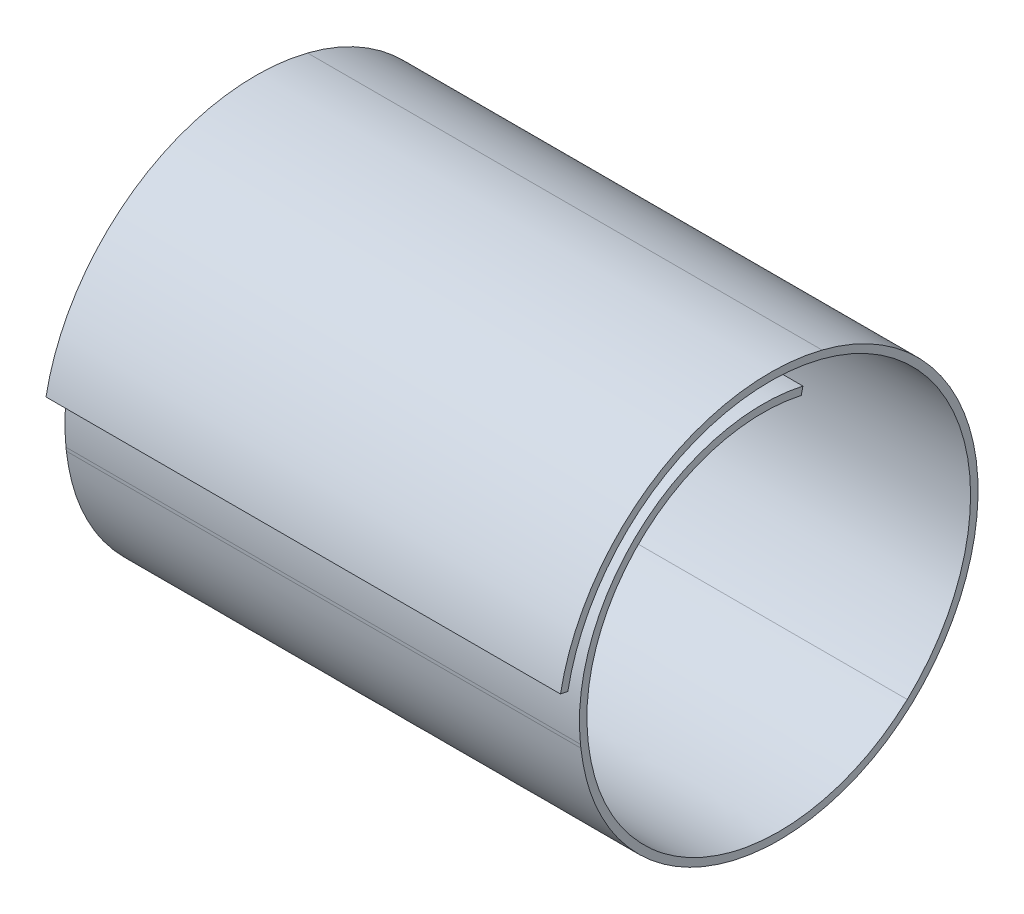
ISO-10303-21;
HEADER;
FILE_DESCRIPTION(('STEP AP214'),'2;1');
FILE_NAME('part.step','',(''),(''),'','','');
FILE_SCHEMA(('AUTOMOTIVE_DESIGN { 1 0 10303 214 1 1 1 1 }'));
ENDSEC;
DATA;
#1=APPLICATION_CONTEXT('core data for automotive mechanical design processes');
#2=APPLICATION_PROTOCOL_DEFINITION('international standard','automotive_design',2000,#1);
#3=PRODUCT_CONTEXT('',#1,'mechanical');
#4=PRODUCT('Part','Part','',(#3));
#5=PRODUCT_RELATED_PRODUCT_CATEGORY('part','',(#4));
#6=PRODUCT_DEFINITION_FORMATION('','',#4);
#7=PRODUCT_DEFINITION_CONTEXT('part definition',#1,'design');
#8=PRODUCT_DEFINITION('design','',#6,#7);
#9=PRODUCT_DEFINITION_SHAPE('','',#8);
#10=(LENGTH_UNIT() NAMED_UNIT(*) SI_UNIT(.MILLI.,.METRE.));
#11=(NAMED_UNIT(*) PLANE_ANGLE_UNIT() SI_UNIT($,.RADIAN.));
#12=(NAMED_UNIT(*) SI_UNIT($,.STERADIAN.) SOLID_ANGLE_UNIT());
#13=UNCERTAINTY_MEASURE_WITH_UNIT(LENGTH_MEASURE(1.E-05),#10,'distance_accuracy_value','');
#14=(GEOMETRIC_REPRESENTATION_CONTEXT(3) GLOBAL_UNCERTAINTY_ASSIGNED_CONTEXT((#13)) GLOBAL_UNIT_ASSIGNED_CONTEXT((#10,
#11,#12)) REPRESENTATION_CONTEXT('',''));
#15=CARTESIAN_POINT('',(0.,0.,0.));
#16=DIRECTION('',(0.,0.,1.));
#17=DIRECTION('',(1.,0.,0.));
#18=AXIS2_PLACEMENT_3D('',#15,#16,#17);
#19=CARTESIAN_POINT('',(17.4034945594457,31.576333585848,2.50708184929004));
#20=DIRECTION('',(1.,0.,0.));
#21=DIRECTION('',(0.,0.249377833365716,-0.968406266102105));
#22=AXIS2_PLACEMENT_3D('',#19,#20,#21);
#23=PLANE('',#22);
#24=CARTESIAN_POINT('',(17.4034945594457,32.0777337419169,0.56));
#25=DIRECTION('',(1.,0.,0.));
#26=DIRECTION('',(0.,0.249377833365716,-0.968406266102105));
#27=AXIS2_PLACEMENT_3D('',#24,#25,#26);
#28=CIRCLE('',#27,0.55);
#29=CARTESIAN_POINT('',(17.4034945594457,32.6112860792963,0.426501298594451));
#30=VERTEX_POINT('',#29);
#31=CARTESIAN_POINT('',(17.4034945594457,31.674989805489,0.185370131700006));
#32=VERTEX_POINT('',#31);
#33=EDGE_CURVE('E11',#30,#32,#28,.F.);
#34=ORIENTED_EDGE('',*,*,#33,.T.);
#35=CARTESIAN_POINT('',(17.4034945594457,31.6749555165695,0.185339993429392));
#36=CARTESIAN_POINT('',(17.4034945594457,31.6698808588592,0.191012359379874));
#37=CARTESIAN_POINT('',(17.4034945594457,31.6648791710446,0.196751028117828));
#38=CARTESIAN_POINT('',(17.4034945594457,31.6550659611719,0.208393311641737));
#39=CARTESIAN_POINT('',(17.4034945594457,31.6502545368846,0.214297008637968));
#40=CARTESIAN_POINT('',(17.4034945594457,31.6361815994223,0.232293079241067));
#41=CARTESIAN_POINT('',(17.4034945594457,31.6272793480714,0.244672684697817));
#42=CARTESIAN_POINT('',(17.4034945594457,31.6106773154205,0.270201991462283));
#43=CARTESIAN_POINT('',(17.4034945594457,31.6029766889723,0.283351142487258));
#44=CARTESIAN_POINT('',(17.4034945594457,31.5887690073118,0.310270250833171));
#45=CARTESIAN_POINT('',(17.4034945594457,31.5822617936804,0.324040125453596));
#46=CARTESIAN_POINT('',(17.4034945594457,31.564550945932,0.366217421023955));
#47=CARTESIAN_POINT('',(17.4034945594457,31.5551995962273,0.395428065101052));
#48=CARTESIAN_POINT('',(17.4034945594457,31.5416568436294,0.454995895010855));
#49=CARTESIAN_POINT('',(17.4034945594457,31.5374638955009,0.485352734682748));
#50=CARTESIAN_POINT('',(17.4034945594457,31.5344775086695,0.545439341617306));
#51=CARTESIAN_POINT('',(17.4034945594457,31.5355289375999,0.575161303097548));
#52=CARTESIAN_POINT('',(17.4034945594457,31.5426069674231,0.634007865221844));
#53=CARTESIAN_POINT('',(17.4034945594457,31.5486342280122,0.663132386132389));
#54=CARTESIAN_POINT('',(17.4034945594457,31.5654504846796,0.719893217469623));
#55=CARTESIAN_POINT('',(17.4034945594457,31.5762278735743,0.747532972432323));
#56=CARTESIAN_POINT('',(17.4034945594457,31.6022035468292,0.800650691027332));
#57=CARTESIAN_POINT('',(17.4034945594457,31.6174018838507,0.82612862890389));
#58=CARTESIAN_POINT('',(17.4034945594457,31.6520475540403,0.874485354845227));
#59=CARTESIAN_POINT('',(17.4034945594457,31.6715441063701,0.897328936873576));
#60=CARTESIAN_POINT('',(17.4034945594457,31.7141097694541,0.939408238404519));
#61=CARTESIAN_POINT('',(17.4034945594457,31.7371799169677,0.958642907309058));
#62=CARTESIAN_POINT('',(17.4034945594457,31.7862010867105,0.993091465363867));
#63=CARTESIAN_POINT('',(17.4034945594457,31.8121573705444,1.00829783422051));
#64=CARTESIAN_POINT('',(17.4034945594457,31.8662539162648,1.03416566326548));
#65=CARTESIAN_POINT('',(17.4034945594457,31.8943921702665,1.04483124464365));
#66=CARTESIAN_POINT('',(17.4034945594457,31.9379021368768,1.05701358362335));
#67=CARTESIAN_POINT('',(17.4034945594457,31.9527621106053,1.0604514550474));
#68=CARTESIAN_POINT('',(17.4034945594457,31.9826703312113,1.06622344220654));
#69=CARTESIAN_POINT('',(17.4034945594457,31.9977181890172,1.06855954273816));
#70=CARTESIAN_POINT('',(17.4034945594457,32.0128022203994,1.07047103077812));
#71=B_SPLINE_CURVE_WITH_KNOTS('',3,(#35,#36,#37,#38,#39,#40,#41,#42,#43,#44,#45,#46,#47,#48,#49,
#50,#51,#52,#53,#54,#55,#56,#57,#58,#59,#60,#61,#62,#63,#64,#65,#66,#67,#68,#69,#70),
.UNSPECIFIED.,.F.,.F.,(4,2,2,2,2,2,2,2,2,2,2,2,2,2,2,2,2,4),(0.,0.0228330581128942,
0.0456777008728943,0.0913578253691487,0.137005675068824,0.182647460866556,0.274157817899441,
0.365640755681724,0.454433899694957,0.543238817806483,0.631827929289291,0.720418096068941,
0.810080922820169,0.899769811137838,0.989624975034345,1.07939841219874,1.12511416390304,
1.17074724292169),.UNSPECIFIED.);
#72=CARTESIAN_POINT('',(17.4034945594457,32.0128085285744,1.07042176268632));
#73=VERTEX_POINT('',#72);
#74=EDGE_CURVE('E261',#32,#73,#71,.T.);
#75=ORIENTED_EDGE('',*,*,#74,.T.);
#76=CARTESIAN_POINT('',(17.4034945594457,32.0128150240828,1.07037252638147));
#77=CARTESIAN_POINT('',(17.4034945594457,32.0159557298064,1.07071470129051));
#78=CARTESIAN_POINT('',(17.4034945594457,32.01909643553,1.07105687619956));
#79=CARTESIAN_POINT('',(17.4034945594457,32.0222371412536,1.07139905110861));
#80=B_SPLINE_CURVE_WITH_KNOTS('',3,(#76,#77,#78,#79),.UNSPECIFIED.,.F.,.F.,(4,4),(0.,1.),.UNSPECIFIED.);
#81=CARTESIAN_POINT('',(17.4034947261124,32.0222369755674,1.07139903305735));
#82=VERTEX_POINT('',#81);
#83=EDGE_CURVE('E319',#73,#82,#80,.T.);
#84=ORIENTED_EDGE('',*,*,#83,.T.);
#85=CARTESIAN_POINT('',(17.4034945594457,32.0753078344884,0.584281423276168));
#86=DIRECTION('',(1.,0.,0.));
#87=DIRECTION('',(0.,0.782950168785445,0.622084426102152));
#88=AXIS2_PLACEMENT_3D('',#85,#86,#87);
#89=CIRCLE('',#88,0.49);
#90=CARTESIAN_POINT('',(17.4034945594457,32.5535585406498,0.477623012065801));
#91=VERTEX_POINT('',#90);
#92=EDGE_CURVE('E413',#82,#91,#89,.F.);
#93=ORIENTED_EDGE('',*,*,#92,.T.);
#94=CARTESIAN_POINT('',(17.4034945594457,32.5340383380673,0.481976364328814));
#95=CARTESIAN_POINT('',(17.4034945594457,32.5405451537209,0.480525228740912));
#96=CARTESIAN_POINT('',(17.4034945594457,32.5470519693745,0.479074093153009));
#97=CARTESIAN_POINT('',(17.4034945594457,32.5535587850281,0.477622957565102));
#98=B_SPLINE_CURVE_WITH_KNOTS('',3,(#94,#95,#96,#97),.UNSPECIFIED.,.F.,.F.,(4,4),(0.,1.),.UNSPECIFIED.);
#99=CARTESIAN_POINT('',(17.4034948094457,32.5340383380673,0.481976364328819));
#100=VERTEX_POINT('',#99);
#101=EDGE_CURVE('E262',#100,#91,#98,.T.);
#102=ORIENTED_EDGE('',*,*,#101,.F.);
#103=CARTESIAN_POINT('',(17.4034945594457,32.0753078344884,0.584281423276168));
#104=DIRECTION('',(1.,0.,0.));
#105=DIRECTION('',(0.,0.782950168785445,0.622084426102152));
#106=AXIS2_PLACEMENT_3D('',#103,#104,#105);
#107=CIRCLE('',#106,0.47);
#108=CARTESIAN_POINT('',(17.4034945594457,32.0244032735538,1.05151686824481));
#109=VERTEX_POINT('',#108);
#110=EDGE_CURVE('E414',#100,#109,#107,.T.);
#111=ORIENTED_EDGE('',*,*,#110,.T.);
#112=CARTESIAN_POINT('',(17.4034945594457,32.0244032916288,1.05151670234011));
#113=CARTESIAN_POINT('',(17.4034945594457,32.0211469033423,1.05116192399925));
#114=CARTESIAN_POINT('',(17.4034945594457,32.0178905150558,1.05080714565839));
#115=CARTESIAN_POINT('',(17.4034945594457,32.0146341267692,1.05045236731752));
#116=B_SPLINE_CURVE_WITH_KNOTS('',3,(#112,#113,#114,#115),.UNSPECIFIED.,.F.,.F.,(4,4),(0.,1.),.UNSPECIFIED.);
#117=CARTESIAN_POINT('',(17.4034945594457,32.0146283783759,1.05049791306767));
#118=VERTEX_POINT('',#117);
#119=EDGE_CURVE('E171',#109,#118,#116,.T.);
#120=ORIENTED_EDGE('',*,*,#119,.T.);
#121=CARTESIAN_POINT('',(17.4034945594457,32.0146225468537,1.05054345194872));
#122=CARTESIAN_POINT('',(17.4034945594457,32.0071313690003,1.04958101969936));
#123=CARTESIAN_POINT('',(17.4034945594457,31.9996517424516,1.04852297924394));
#124=CARTESIAN_POINT('',(17.4034945594457,31.9847274643567,1.04616244104803));
#125=CARTESIAN_POINT('',(17.4034945594457,31.9772828330994,1.04485981602401));
#126=CARTESIAN_POINT('',(17.4034945594457,31.9550339824592,1.04050732137104));
#127=CARTESIAN_POINT('',(17.4034945594457,31.9403117673695,1.03701248595999));
#128=CARTESIAN_POINT('',(17.4034945594457,31.911260590548,1.02866056190973));
#129=CARTESIAN_POINT('',(17.4034945594457,31.8969315604787,1.02380371166311));
#130=CARTESIAN_POINT('',(17.4034945594457,31.8687660896645,1.01284439663057));
#131=CARTESIAN_POINT('',(17.4034945594457,31.8549296084538,1.00674203444971));
#132=CARTESIAN_POINT('',(17.4034945594457,31.8142105720705,0.986595982042587));
#133=CARTESIAN_POINT('',(17.4034945594457,31.7881994805376,0.970737014887083));
#134=CARTESIAN_POINT('',(17.4034945594457,31.7393475472101,0.934761226469895));
#135=CARTESIAN_POINT('',(17.4034945594457,31.7165051801177,0.914646465635297));
#136=CARTESIAN_POINT('',(17.4034945594457,31.6755879834309,0.871548453723191));
#137=CARTESIAN_POINT('',(17.4034945594457,31.6573596750745,0.848711100845915));
#138=CARTESIAN_POINT('',(17.4034945594457,31.6250405273982,0.800275083580968));
#139=CARTESIAN_POINT('',(17.4034945594457,31.6109500778659,0.774676159362759));
#140=CARTESIAN_POINT('',(17.4034945594457,31.5874719148749,0.721802707346989));
#141=CARTESIAN_POINT('',(17.4034945594457,31.5780255720152,0.694554221218969));
#142=CARTESIAN_POINT('',(17.4034945594457,31.5638722109344,0.638855069779683));
#143=CARTESIAN_POINT('',(17.4034945594457,31.5591645322796,0.610404572570298));
#144=CARTESIAN_POINT('',(17.4034945594457,31.5546385648352,0.553214671548608));
#145=CARTESIAN_POINT('',(17.4034945594457,31.5548037472727,0.524476574863599));
#146=CARTESIAN_POINT('',(17.4034945594457,31.559995169336,0.467444545881685));
#147=CARTESIAN_POINT('',(17.4034945594457,31.5650207417493,0.43915055316193));
#148=CARTESIAN_POINT('',(17.4034945594457,31.579727825617,0.383970354745448));
#149=CARTESIAN_POINT('',(17.4034945594457,31.5893844467411,0.357077465463148));
#150=CARTESIAN_POINT('',(17.4034945594457,31.6131021036585,0.305305831507777));
#151=CARTESIAN_POINT('',(17.4034945594457,31.6271583419195,0.28042492988775));
#152=CARTESIAN_POINT('',(17.4034945594457,31.6503562713996,0.246827657433763));
#153=CARTESIAN_POINT('',(17.4034945594457,31.6578016614421,0.236905605360861));
#154=CARTESIAN_POINT('',(17.4034945594457,31.6732960506261,0.217572800584074));
#155=CARTESIAN_POINT('',(17.4034945594457,31.6813438815663,0.208161116378662));
#156=CARTESIAN_POINT('',(17.4034945594457,31.6896105355137,0.198958261299011));
#157=B_SPLINE_CURVE_WITH_KNOTS('',3,(#121,#122,#123,#124,#125,#126,#127,#128,#129,#130,#131,
#132,#133,#134,#135,#136,#137,#138,#139,#140,#141,#142,#143,#144,#145,#146,#147,#148,#149,#150,
#151,#152,#153,#154,#155,#156),.UNSPECIFIED.,.F.,.F.,(4,2,2,2,2,2,2,2,2,2,2,2,2,2,2,2,2,4),(0.,
0.0226581640476718,0.0453281524102517,0.0906589762910414,0.135981870893229,0.181301033309083,
0.272189195999313,0.363033455796986,0.450264762667146,0.537504284120661,0.623612203941445,
0.709708121129474,0.795512034154393,0.88130417007215,0.966640283517333,1.0518836650759,
1.08907415524453,1.12619430920823),.UNSPECIFIED.);
#158=CARTESIAN_POINT('',(17.4034945594457,31.6896373591719,0.19899234595065));
#159=VERTEX_POINT('',#158);
#160=EDGE_CURVE('E245',#118,#159,#157,.T.);
#161=ORIENTED_EDGE('',*,*,#160,.T.);
#162=CARTESIAN_POINT('',(17.4034945594457,32.0777337419169,0.56));
#163=DIRECTION('',(1.,0.,0.));
#164=DIRECTION('',(0.,0.249377833365716,-0.968406266102105));
#165=AXIS2_PLACEMENT_3D('',#162,#163,#164);
#166=CIRCLE('',#165,0.53);
#167=CARTESIAN_POINT('',(17.4034945594457,32.5918844188041,0.431355736105759));
#168=VERTEX_POINT('',#167);
#169=EDGE_CURVE('E56',#159,#168,#166,.T.);
#170=ORIENTED_EDGE('',*,*,#169,.T.);
#171=CARTESIAN_POINT('',(17.4034945594457,32.0583318387619,0.564854498227317));
#172=DIRECTION('',(1.,0.,0.));
#173=DIRECTION('',(0.,0.814602386089999,0.580019786366362));
#174=AXIS2_PLACEMENT_3D('',#171,#172,#173);
#175=CIRCLE('',#174,0.55);
#176=CARTESIAN_POINT('',(17.4034945594457,32.1613807466414,1.10511454911471));
#177=VERTEX_POINT('',#176);
#178=EDGE_CURVE('E151',#168,#177,#175,.T.);
#179=ORIENTED_EDGE('',*,*,#178,.T.);
#180=CARTESIAN_POINT('',(17.4034945594457,32.1651279796552,1.12476036914697));
#181=CARTESIAN_POINT('',(17.4034945594457,32.1638789019839,1.11821176246958));
#182=CARTESIAN_POINT('',(17.4034945594457,32.1626298243127,1.11166315579211));
#183=CARTESIAN_POINT('',(17.4034945594457,32.1613807466414,1.10511454911471));
#184=B_SPLINE_CURVE_WITH_KNOTS('',3,(#180,#181,#182,#183),.UNSPECIFIED.,.F.,.F.,(4,4),(-2.E-05,
0.),.UNSPECIFIED.);
#185=CARTESIAN_POINT('',(17.4034945594457,32.1651279796552,1.12476036914697));
#186=VERTEX_POINT('',#185);
#187=EDGE_CURVE('E149',#186,#177,#184,.T.);
#188=ORIENTED_EDGE('',*,*,#187,.F.);
#189=CARTESIAN_POINT('',(17.4034945594457,32.0583318387619,0.564854498227317));
#190=DIRECTION('',(1.,0.,0.));
#191=DIRECTION('',(0.,0.814602386089999,0.580019786366362));
#192=AXIS2_PLACEMENT_3D('',#189,#190,#191);
#193=CIRCLE('',#192,0.57);
#194=EDGE_CURVE('E138',#186,#30,#193,.F.);
#195=ORIENTED_EDGE('',*,*,#194,.T.);
#196=EDGE_LOOP('',(#34,#75,#84,#93,#102,#111,#120,#161,#170,#179,#188,#195));
#197=FACE_BOUND('',#196,.T.);
#198=ADVANCED_FACE('F45',(#197),#23,.F.);
#199=CARTESIAN_POINT('',(18.776946648284,31.576333585848,2.50708184929004));
#200=DIRECTION('',(1.,0.,0.));
#201=DIRECTION('',(0.,0.249377833365716,-0.968406266102105));
#202=AXIS2_PLACEMENT_3D('',#199,#200,#201);
#203=PLANE('',#202);
#204=CARTESIAN_POINT('',(18.776946648284,32.0777337419169,0.56));
#205=DIRECTION('',(1.,0.,0.));
#206=DIRECTION('',(0.,0.249377833365716,-0.968406266102105));
#207=AXIS2_PLACEMENT_3D('',#204,#205,#206);
#208=CIRCLE('',#207,0.53);
#209=CARTESIAN_POINT('',(18.776946648284,32.5918841761189,0.431355796827378));
#210=VERTEX_POINT('',#209);
#211=CARTESIAN_POINT('',(18.776946648284,31.6896362141877,0.198993564245657));
#212=VERTEX_POINT('',#211);
#213=EDGE_CURVE('E360',#210,#212,#208,.F.);
#214=ORIENTED_EDGE('',*,*,#213,.T.);
#215=CARTESIAN_POINT('',(18.776946648284,31.689610644695,0.198958139428983));
#216=CARTESIAN_POINT('',(18.776946648284,31.6847315464127,0.204407954787204));
#217=CARTESIAN_POINT('',(18.776946648284,31.6799209034134,0.209920367138521));
#218=CARTESIAN_POINT('',(18.776946648284,31.6704831173776,0.221104263719451));
#219=CARTESIAN_POINT('',(18.776946648284,31.665856064368,0.226775823718865));
#220=CARTESIAN_POINT('',(18.776946648284,31.6523299530354,0.244068671711127));
#221=CARTESIAN_POINT('',(18.776946648284,31.6437829828795,0.255971331313172));
#222=CARTESIAN_POINT('',(18.776946648284,31.627840861088,0.280511545086618));
#223=CARTESIAN_POINT('',(18.776946648284,31.6204448327168,0.293148529703588));
#224=CARTESIAN_POINT('',(18.776946648284,31.6067880468123,0.319014674381316));
#225=CARTESIAN_POINT('',(18.776946648284,31.6005272321068,0.332243804578184));
#226=CARTESIAN_POINT('',(18.776946648284,31.5834822922947,0.372766428967498));
#227=CARTESIAN_POINT('',(18.776946648284,31.5744757999698,0.400832887265762));
#228=CARTESIAN_POINT('',(18.776946648284,31.5614399783842,0.458073961051429));
#229=CARTESIAN_POINT('',(18.776946648284,31.5574092748176,0.487248268256794));
#230=CARTESIAN_POINT('',(18.776946648284,31.5545241614414,0.54493643041323));
#231=CARTESIAN_POINT('',(18.776946648284,31.5555115157422,0.573442336230113));
#232=CARTESIAN_POINT('',(18.776946648284,31.5622367459496,0.62992769946215));
#233=CARTESIAN_POINT('',(18.776946648284,31.5679813805511,0.657906349928945));
#234=CARTESIAN_POINT('',(18.776946648284,31.5840739822803,0.712528393235883));
#235=CARTESIAN_POINT('',(18.776946648284,31.5944253665207,0.739170778531604));
#236=CARTESIAN_POINT('',(18.776946648284,31.6194005013863,0.790367444859207));
#237=CARTESIAN_POINT('',(18.776946648284,31.6340239439178,0.81492187630593));
#238=CARTESIAN_POINT('',(18.776946648284,31.6673375990225,0.861508714508739));
#239=CARTESIAN_POINT('',(18.776946648284,31.6860705014505,0.883510632715888));
#240=CARTESIAN_POINT('',(18.776946648284,31.7269436508198,0.924022224118295));
#241=CARTESIAN_POINT('',(18.776946648284,31.7490796241725,0.942536213451752));
#242=CARTESIAN_POINT('',(18.776946648284,31.7961823659138,0.975725042879554));
#243=CARTESIAN_POINT('',(18.776946648284,31.8211598942355,0.990384543967301));
#244=CARTESIAN_POINT('',(18.776946648284,31.8732130395136,1.01534739024026));
#245=CARTESIAN_POINT('',(18.776946648284,31.9002868427462,1.02565445245695));
#246=CARTESIAN_POINT('',(18.776946648284,31.9422158264845,1.0374775188847));
#247=CARTESIAN_POINT('',(18.776946648284,31.9565778210686,1.04082824055041));
#248=CARTESIAN_POINT('',(18.776946648284,31.9854880972761,1.04644265349602));
#249=CARTESIAN_POINT('',(18.776946648284,32.0000359841042,1.04870834884744));
#250=CARTESIAN_POINT('',(18.776946648284,32.0146222989028,1.05054342019714));
#251=B_SPLINE_CURVE_WITH_KNOTS('',3,(#215,#216,#217,#218,#219,#220,#221,#222,#223,#224,#225,
#226,#227,#228,#229,#230,#231,#232,#233,#234,#235,#236,#237,#238,#239,#240,#241,#242,#243,#244,
#245,#246,#247,#248,#249,#250),.UNSPECIFIED.,.F.,.F.,(4,2,2,2,2,2,2,2,2,2,2,2,2,2,2,2,2,4),(0.,
0.0219447424569018,0.0439001162077482,0.0877978143042911,0.131661907675626,0.175523791320458,
0.263466761168063,0.351385435850641,0.436549278842833,0.521834322577395,0.607182733249301,
0.692524990258994,0.778799743117878,0.864967023756314,0.951472189310512,1.03790332834232,
1.08210495938596,1.12622463095276),.UNSPECIFIED.);
#252=CARTESIAN_POINT('',(18.776946648284,32.0146281301622,1.05049788347527));
#253=VERTEX_POINT('',#252);
#254=EDGE_CURVE('E311',#212,#253,#251,.T.);
#255=ORIENTED_EDGE('',*,*,#254,.T.);
#256=CARTESIAN_POINT('',(18.776946648284,32.0146341267692,1.05045236731752));
#257=CARTESIAN_POINT('',(18.776946648284,32.0178905150558,1.05080714565839));
#258=CARTESIAN_POINT('',(18.776946648284,32.0211469033423,1.05116192399925));
#259=CARTESIAN_POINT('',(18.776946648284,32.0244032916288,1.05151670234011));
#260=B_SPLINE_CURVE_WITH_KNOTS('',3,(#256,#257,#258,#259),.UNSPECIFIED.,.F.,.F.,(4,4),(0.,1.),.UNSPECIFIED.);
#261=CARTESIAN_POINT('',(18.776946648284,32.0244031259426,1.05151668428885));
#262=VERTEX_POINT('',#261);
#263=EDGE_CURVE('E173',#253,#262,#260,.T.);
#264=ORIENTED_EDGE('',*,*,#263,.T.);
#265=CARTESIAN_POINT('',(18.776946648284,32.0753078344884,0.584281423276168));
#266=DIRECTION('',(1.,0.,0.));
#267=DIRECTION('',(0.,0.782950168785445,0.622084426102152));
#268=AXIS2_PLACEMENT_3D('',#265,#266,#267);
#269=CIRCLE('',#268,0.47);
#270=CARTESIAN_POINT('',(18.776946648284,32.5340383380673,0.481976364328819));
#271=VERTEX_POINT('',#270);
#272=EDGE_CURVE('E426',#262,#271,#269,.F.);
#273=ORIENTED_EDGE('',*,*,#272,.T.);
#274=CARTESIAN_POINT('',(18.776946648284,32.5535587850281,0.477622957565102));
#275=CARTESIAN_POINT('',(18.776946648284,32.5470519693745,0.479074093153016));
#276=CARTESIAN_POINT('',(18.776946648284,32.5405451537209,0.480525228740916));
#277=CARTESIAN_POINT('',(18.776946648284,32.5340383380673,0.481976364328814));
#278=B_SPLINE_CURVE_WITH_KNOTS('',3,(#274,#275,#276,#277),.UNSPECIFIED.,.F.,.F.,(4,4),(-2.E-05,
0.),.UNSPECIFIED.);
#279=CARTESIAN_POINT('',(18.776946648284,32.5535587850281,0.477622957565101));
#280=VERTEX_POINT('',#279);
#281=EDGE_CURVE('E471',#271,#280,#278,.F.);
#282=ORIENTED_EDGE('',*,*,#281,.T.);
#283=CARTESIAN_POINT('',(18.776946648284,32.0753078344884,0.584281423276168));
#284=DIRECTION('',(1.,0.,0.));
#285=DIRECTION('',(0.,0.782950168785445,0.622084426102152));
#286=AXIS2_PLACEMENT_3D('',#283,#284,#285);
#287=CIRCLE('',#286,0.49);
#288=CARTESIAN_POINT('',(18.776946648284,32.0222369755674,1.07139903305735));
#289=VERTEX_POINT('',#288);
#290=EDGE_CURVE('E412',#289,#280,#287,.F.);
#291=ORIENTED_EDGE('',*,*,#290,.F.);
#292=CARTESIAN_POINT('',(18.776946648284,32.0128150240828,1.07037252638147));
#293=CARTESIAN_POINT('',(18.776946648284,32.0159557298064,1.07071470129051));
#294=CARTESIAN_POINT('',(18.776946648284,32.01909643553,1.07105687619956));
#295=CARTESIAN_POINT('',(18.776946648284,32.0222371412536,1.07139905110861));
#296=B_SPLINE_CURVE_WITH_KNOTS('',3,(#292,#293,#294,#295),.UNSPECIFIED.,.F.,.F.,(4,4),(0.,1.),.UNSPECIFIED.);
#297=CARTESIAN_POINT('',(18.776946648284,32.0128085285745,1.07042176268635));
#298=VERTEX_POINT('',#297);
#299=EDGE_CURVE('E333',#298,#289,#296,.T.);
#300=ORIENTED_EDGE('',*,*,#299,.F.);
#301=CARTESIAN_POINT('',(18.776946648284,31.6749555165696,0.185339993429449));
#302=CARTESIAN_POINT('',(18.776946648284,31.6698808588593,0.191012359379937));
#303=CARTESIAN_POINT('',(18.776946648284,31.6648791710446,0.196751028117883));
#304=CARTESIAN_POINT('',(18.776946648284,31.6550659611719,0.208393311641765));
#305=CARTESIAN_POINT('',(18.776946648284,31.6502545368845,0.214297008637977));
#306=CARTESIAN_POINT('',(18.776946648284,31.6361815994222,0.232293079241031));
#307=CARTESIAN_POINT('',(18.776946648284,31.6272793480713,0.244672684697771));
#308=CARTESIAN_POINT('',(18.776946648284,31.6106773154204,0.270201991462256));
#309=CARTESIAN_POINT('',(18.776946648284,31.6029766889722,0.28335114248726));
#310=CARTESIAN_POINT('',(18.776946648284,31.5887690073118,0.310270250833223));
#311=CARTESIAN_POINT('',(18.776946648284,31.5822617936804,0.324040125453668));
#312=CARTESIAN_POINT('',(18.776946648284,31.5645509459321,0.366217421024052));
#313=CARTESIAN_POINT('',(18.776946648284,31.5551995962273,0.395428065101139));
#314=CARTESIAN_POINT('',(18.776946648284,31.5416568436294,0.454995895010925));
#315=CARTESIAN_POINT('',(18.776946648284,31.5374638955008,0.485352734682809));
#316=CARTESIAN_POINT('',(18.776946648284,31.5344775086694,0.545439341617515));
#317=CARTESIAN_POINT('',(18.776946648284,31.5355289375999,0.575161303097914));
#318=CARTESIAN_POINT('',(18.776946648284,31.5426069674232,0.634007865222512));
#319=CARTESIAN_POINT('',(18.776946648284,31.5486342280124,0.663132386133201));
#320=CARTESIAN_POINT('',(18.776946648284,31.56545048468,0.719893217470542));
#321=CARTESIAN_POINT('',(18.776946648284,31.5762278735747,0.747532972433212));
#322=CARTESIAN_POINT('',(18.776946648284,31.6022035468296,0.800650691028159));
#323=CARTESIAN_POINT('',(18.776946648284,31.6174018838512,0.826128628904685));
#324=CARTESIAN_POINT('',(18.776946648284,31.6520475540409,0.874485354845943));
#325=CARTESIAN_POINT('',(18.776946648284,31.6715441063707,0.897328936874246));
#326=CARTESIAN_POINT('',(18.776946648284,31.7141097694547,0.939408238405102));
#327=CARTESIAN_POINT('',(18.776946648284,31.7371799169684,0.958642907309599));
#328=CARTESIAN_POINT('',(18.776946648284,31.7862010867112,0.993091465364332));
#329=CARTESIAN_POINT('',(18.776946648284,31.8121573705451,1.00829783422093));
#330=CARTESIAN_POINT('',(18.776946648284,31.8662539162656,1.03416566326579));
#331=CARTESIAN_POINT('',(18.776946648284,31.8943921702674,1.04483124464389));
#332=CARTESIAN_POINT('',(18.776946648284,31.9379021368776,1.0570135836235));
#333=CARTESIAN_POINT('',(18.776946648284,31.9527621106059,1.06045145504751));
#334=CARTESIAN_POINT('',(18.776946648284,31.9826703312117,1.0662234422066));
#335=CARTESIAN_POINT('',(18.776946648284,31.9977181890174,1.06855954273821));
#336=CARTESIAN_POINT('',(18.776946648284,32.0128022203995,1.07047103077816));
#337=B_SPLINE_CURVE_WITH_KNOTS('',3,(#301,#302,#303,#304,#305,#306,#307,#308,#309,#310,#311,
#312,#313,#314,#315,#316,#317,#318,#319,#320,#321,#322,#323,#324,#325,#326,#327,#328,#329,#330,
#331,#332,#333,#334,#335,#336),.UNSPECIFIED.,.F.,.F.,(4,2,2,2,2,2,2,2,2,2,2,2,2,2,2,2,2,4),(0.,
0.0228330581129149,0.0456777008729262,0.0913578253691947,0.137005675068894,0.182647460866654,
0.274157817899522,0.36564075568179,0.454433899695486,0.543238817807477,0.631827929290261,
0.720418096069886,0.810080922821069,0.899769811138672,0.989624975035222,1.07939841219969,
1.12511416390358,1.1707472429218),.UNSPECIFIED.);
#338=CARTESIAN_POINT('',(18.776946648284,31.6749898054891,0.18537013170004));
#339=VERTEX_POINT('',#338);
#340=EDGE_CURVE('E246',#339,#298,#337,.T.);
#341=ORIENTED_EDGE('',*,*,#340,.F.);
#342=CARTESIAN_POINT('',(18.776946648284,32.0777337419169,0.56));
#343=DIRECTION('',(1.,0.,0.));
#344=DIRECTION('',(0.,0.249377833365716,-0.968406266102105));
#345=AXIS2_PLACEMENT_3D('',#342,#343,#344);
#346=CIRCLE('',#345,0.55);
#347=CARTESIAN_POINT('',(18.776946648284,32.6112860792963,0.426501298594451));
#348=VERTEX_POINT('',#347);
#349=EDGE_CURVE('E78',#348,#339,#346,.F.);
#350=ORIENTED_EDGE('',*,*,#349,.F.);
#351=CARTESIAN_POINT('',(18.776946648284,32.0583318387619,0.564854498227317));
#352=DIRECTION('',(1.,0.,0.));
#353=DIRECTION('',(0.,0.814602386089999,0.580019786366362));
#354=AXIS2_PLACEMENT_3D('',#351,#352,#353);
#355=CIRCLE('',#354,0.57);
#356=CARTESIAN_POINT('',(18.776946648284,32.1651279796552,1.12476036914697));
#357=VERTEX_POINT('',#356);
#358=EDGE_CURVE('E146',#357,#348,#355,.F.);
#359=ORIENTED_EDGE('',*,*,#358,.F.);
#360=CARTESIAN_POINT('',(18.776946648284,32.1651279796552,1.12476036914697));
#361=CARTESIAN_POINT('',(18.776946648284,32.1638789019839,1.11821176246958));
#362=CARTESIAN_POINT('',(18.776946648284,32.1626298243127,1.11166315579211));
#363=CARTESIAN_POINT('',(18.776946648284,32.1613807466414,1.10511454911471));
#364=B_SPLINE_CURVE_WITH_KNOTS('',3,(#360,#361,#362,#363),.UNSPECIFIED.,.F.,.F.,(4,4),(-2.E-05,
0.),.UNSPECIFIED.);
#365=CARTESIAN_POINT('',(18.776946648284,32.1613807466414,1.10511454911471));
#366=VERTEX_POINT('',#365);
#367=EDGE_CURVE('E155',#366,#357,#364,.F.);
#368=ORIENTED_EDGE('',*,*,#367,.F.);
#369=CARTESIAN_POINT('',(18.776946648284,32.0583318387619,0.564854498227317));
#370=DIRECTION('',(1.,0.,0.));
#371=DIRECTION('',(0.,0.814602386089999,0.580019786366362));
#372=AXIS2_PLACEMENT_3D('',#369,#370,#371);
#373=CIRCLE('',#372,0.55);
#374=EDGE_CURVE('E168',#366,#210,#373,.F.);
#375=ORIENTED_EDGE('',*,*,#374,.T.);
#376=EDGE_LOOP('',(#214,#255,#264,#273,#282,#291,#300,#341,#350,#359,#368,#375));
#377=FACE_BOUND('',#376,.T.);
#378=ADVANCED_FACE('F358',(#377),#203,.T.);
#379=CARTESIAN_POINT('',(17.403494559403,32.0777337419169,0.56));
#380=DIRECTION('',(1.,0.,0.));
#381=DIRECTION('',(0.,0.968406266102103,0.249377833365726));
#382=AXIS2_PLACEMENT_3D('',#379,#380,#381);
#383=CYLINDRICAL_SURFACE('',#382,0.53);
#384=CARTESIAN_POINT('',(18.9142918571678,31.6896060728982,0.198963242592225));
#385=CARTESIAN_POINT('',(18.3649110216329,31.6896060728981,0.198963242592036));
#386=CARTESIAN_POINT('',(17.8155301860968,31.6896060728983,0.198963242592472));
#387=CARTESIAN_POINT('',(17.266149350562,31.6896060728981,0.198963242592055));
#388=B_SPLINE_CURVE_WITH_KNOTS('',3,(#384,#385,#386,#387),.UNSPECIFIED.,.F.,.F.,(4,4),
(0.0172661493505619,0.0189142918571679),.UNSPECIFIED.);
#389=EDGE_CURVE('E174',#212,#159,#388,.T.);
#390=ORIENTED_EDGE('',*,*,#389,.F.);
#391=ORIENTED_EDGE('',*,*,#213,.F.);
#392=DIRECTION('',(1.,0.,0.));
#393=VECTOR('',#392,1.);
#394=CARTESIAN_POINT('',(23.8615664419416,32.5918841761413,0.431355796821773));
#395=LINE('',#394,#393);
#396=EDGE_CURVE('E159',#210,#168,#395,.F.);
#397=ORIENTED_EDGE('',*,*,#396,.T.);
#398=ORIENTED_EDGE('',*,*,#169,.F.);
#399=EDGE_LOOP('',(#390,#391,#397,#398));
#400=FACE_BOUND('',#399,.T.);
#401=ADVANCED_FACE('F385',(#400),#383,.F.);
#402=CARTESIAN_POINT('',(17.403494559403,32.0777337419169,0.56));
#403=DIRECTION('',(1.,0.,0.));
#404=DIRECTION('',(0.,0.968406266102103,0.249377833365726));
#405=AXIS2_PLACEMENT_3D('',#402,#403,#404);
#406=CYLINDRICAL_SURFACE('',#405,0.55);
#407=ORIENTED_EDGE('',*,*,#349,.T.);
#408=CARTESIAN_POINT('',(17.2661493505619,31.6749566610453,0.185338715193999));
#409=CARTESIAN_POINT('',(17.8155301860968,31.6749566610455,0.185338715194685));
#410=CARTESIAN_POINT('',(18.364911021633,31.6749566610451,0.185338715193654));
#411=CARTESIAN_POINT('',(18.9142918571677,31.6749566610454,0.185338715194359));
#412=B_SPLINE_CURVE_WITH_KNOTS('',3,(#408,#409,#410,#411),.UNSPECIFIED.,.F.,.F.,(4,4),
(0.0172661493505619,0.0189142918571679),.UNSPECIFIED.);
#413=EDGE_CURVE('E321',#339,#32,#412,.F.);
#414=ORIENTED_EDGE('',*,*,#413,.T.);
#415=ORIENTED_EDGE('',*,*,#33,.F.);
#416=DIRECTION('',(1.,0.,0.));
#417=VECTOR('',#416,1.);
#418=CARTESIAN_POINT('',(17.403494559403,32.6112860793187,0.42650129858884));
#419=LINE('',#418,#417);
#420=EDGE_CURVE('E144',#348,#30,#419,.F.);
#421=ORIENTED_EDGE('',*,*,#420,.F.);
#422=EDGE_LOOP('',(#407,#414,#415,#421));
#423=FACE_BOUND('',#422,.T.);
#424=ADVANCED_FACE('F47',(#423),#406,.T.);
#425=CARTESIAN_POINT('',(17.4034945594457,32.5535587850281,0.477622957565102));
#426=DIRECTION('',(0.,0.217670338185752,0.9760223480403));
#427=DIRECTION('',(0.,-0.9760223480403,0.217670338185752));
#428=AXIS2_PLACEMENT_3D('',#425,#426,#427);
#429=PLANE('',#428);
#430=ORIENTED_EDGE('',*,*,#101,.T.);
#431=DIRECTION('',(1.,0.,0.));
#432=VECTOR('',#431,1.);
#433=CARTESIAN_POINT('',(17.4034945594457,32.5535587850281,0.477622957565101));
#434=LINE('',#433,#432);
#435=EDGE_CURVE('E427',#91,#280,#434,.T.);
#436=ORIENTED_EDGE('',*,*,#435,.T.);
#437=ORIENTED_EDGE('',*,*,#281,.F.);
#438=DIRECTION('',(1.,0.,0.));
#439=VECTOR('',#438,1.);
#440=CARTESIAN_POINT('',(17.4034945594457,32.5340383380673,0.481976364328819));
#441=LINE('',#440,#439);
#442=EDGE_CURVE('E417',#271,#100,#441,.F.);
#443=ORIENTED_EDGE('',*,*,#442,.T.);
#444=EDGE_LOOP('',(#430,#436,#437,#443));
#445=FACE_BOUND('',#444,.T.);
#446=ADVANCED_FACE('F398',(#445),#429,.F.);
#447=CARTESIAN_POINT('',(17.403494559403,32.0753078344884,0.584281423276168));
#448=DIRECTION('',(1.,0.,0.));
#449=DIRECTION('',(0.,-0.62208442610216,0.782950168785439));
#450=AXIS2_PLACEMENT_3D('',#447,#448,#449);
#451=CYLINDRICAL_SURFACE('',#450,0.49);
#452=DIRECTION('',(1.,0.,0.));
#453=VECTOR('',#452,1.);
#454=CARTESIAN_POINT('',(23.93205417804,32.0222371502968,1.07139896810436));
#455=LINE('',#454,#453);
#456=EDGE_CURVE('E365',#289,#82,#455,.F.);
#457=ORIENTED_EDGE('',*,*,#456,.F.);
#458=ORIENTED_EDGE('',*,*,#290,.T.);
#459=ORIENTED_EDGE('',*,*,#435,.F.);
#460=ORIENTED_EDGE('',*,*,#92,.F.);
#461=EDGE_LOOP('',(#457,#458,#459,#460));
#462=FACE_BOUND('',#461,.T.);
#463=ADVANCED_FACE('F400',(#462),#451,.T.);
#464=CARTESIAN_POINT('',(17.403494559403,32.0753078344884,0.584281423276168));
#465=DIRECTION('',(1.,0.,0.));
#466=DIRECTION('',(0.,-0.62208442610216,0.782950168785439));
#467=AXIS2_PLACEMENT_3D('',#464,#465,#466);
#468=CYLINDRICAL_SURFACE('',#467,0.47);
#469=DIRECTION('',(1.,0.,0.));
#470=VECTOR('',#469,1.);
#471=CARTESIAN_POINT('',(17.403494559403,32.024403300672,1.05151661933586));
#472=LINE('',#471,#470);
#473=EDGE_CURVE('E361',#262,#109,#472,.F.);
#474=ORIENTED_EDGE('',*,*,#473,.T.);
#475=ORIENTED_EDGE('',*,*,#110,.F.);
#476=ORIENTED_EDGE('',*,*,#442,.F.);
#477=ORIENTED_EDGE('',*,*,#272,.F.);
#478=EDGE_LOOP('',(#474,#475,#476,#477));
#479=FACE_BOUND('',#478,.T.);
#480=ADVANCED_FACE('F272',(#479),#468,.F.);
#481=CARTESIAN_POINT('',(17.2661493505619,32.1271362021547,1.0828290932834));
#482=CARTESIAN_POINT('',(17.2661493505614,32.0885886291675,1.07752549601158));
#483=CARTESIAN_POINT('',(17.2661493505622,32.0277040305914,1.07407235446037));
#484=CARTESIAN_POINT('',(17.2661493505618,31.9196557309831,1.05561187000838));
#485=CARTESIAN_POINT('',(17.2661493505618,31.7947698064458,1.00688380073545));
#486=CARTESIAN_POINT('',(17.266149350562,31.6747941502781,0.911860717363528));
#487=CARTESIAN_POINT('',(17.2661493505618,31.5899685437466,0.787036778272611));
#488=CARTESIAN_POINT('',(17.2661493505621,31.5449804725297,0.666460516866639));
#489=CARTESIAN_POINT('',(17.2661493505616,31.5276608307146,0.517728487378619));
#490=CARTESIAN_POINT('',(17.2661493505622,31.5555871646533,0.370281752487997));
#491=CARTESIAN_POINT('',(17.2661493505619,31.616590612305,0.254843284589591));
#492=CARTESIAN_POINT('',(17.266149350562,31.6830464408148,0.173804017704386));
#493=CARTESIAN_POINT('',(17.2661493505618,31.7280199557796,0.130001610771598));
#494=CARTESIAN_POINT('',(17.2661493505619,31.7533475257641,0.101197592802846));
#495=CARTESIAN_POINT('',(17.8155301860972,32.1271362021547,1.08282909328358));
#496=CARTESIAN_POINT('',(17.8155301860986,32.0885886291664,1.07752549600857));
#497=CARTESIAN_POINT('',(17.8155301860962,32.0277040305924,1.07407235446285));
#498=CARTESIAN_POINT('',(17.8155301860978,31.9196557309823,1.05561187000629));
#499=CARTESIAN_POINT('',(17.8155301860974,31.7947698064462,1.00688380073654));
#500=CARTESIAN_POINT('',(17.8155301860965,31.6747941502782,0.911860717363908));
#501=CARTESIAN_POINT('',(17.8155301860979,31.589968543746,0.787036778271074));
#502=CARTESIAN_POINT('',(17.8155301860963,31.5449804725308,0.666460516869629));
#503=CARTESIAN_POINT('',(17.8155301860986,31.5276608307125,0.517728487373277));
#504=CARTESIAN_POINT('',(17.8155301860953,31.5555871646556,0.370281752494008));
#505=CARTESIAN_POINT('',(17.8155301860984,31.6165906123029,0.254843284584106));
#506=CARTESIAN_POINT('',(17.8155301860959,31.6830464408164,0.173804017708397));
#507=CARTESIAN_POINT('',(17.8155301860983,31.7280199557781,0.130001610767696));
#508=CARTESIAN_POINT('',(17.8155301860972,31.7533475257641,0.101197592802972));
#509=CARTESIAN_POINT('',(18.3649110216326,32.1271362021547,1.08282909328334));
#510=CARTESIAN_POINT('',(18.3649110216315,32.0885886291677,1.07752549601226));
#511=CARTESIAN_POINT('',(18.3649110216333,32.0277040305913,1.07407235445986));
#512=CARTESIAN_POINT('',(18.3649110216321,31.9196557309834,1.05561187000915));
#513=CARTESIAN_POINT('',(18.3649110216323,31.7947698064456,1.00688380073488));
#514=CARTESIAN_POINT('',(18.3649110216333,31.6747941502781,0.911860717363653));
#515=CARTESIAN_POINT('',(18.3649110216318,31.5899685437468,0.787036778273312));
#516=CARTESIAN_POINT('',(18.3649110216334,31.544980472529,0.666460516865008));
#517=CARTESIAN_POINT('',(18.3649110216311,31.5276608307156,0.517728487381438));
#518=CARTESIAN_POINT('',(18.3649110216348,31.5555871646521,0.370281752484904));
#519=CARTESIAN_POINT('',(18.3649110216309,31.6165906123061,0.254843284592436));
#520=CARTESIAN_POINT('',(18.3649110216342,31.683046440814,0.173804017702289));
#521=CARTESIAN_POINT('',(18.3649110216312,31.7280199557804,0.130001610773763));
#522=CARTESIAN_POINT('',(18.3649110216325,31.7533475257641,0.101197592802716));
#523=CARTESIAN_POINT('',(18.9142918571679,32.1271362021547,1.08282909328348));
#524=CARTESIAN_POINT('',(18.9142918571681,32.088588629167,1.0775254960104));
#525=CARTESIAN_POINT('',(18.9142918571677,32.0277040305918,1.0740723544613));
#526=CARTESIAN_POINT('',(18.914291857168,31.9196557309827,1.05561187000748));
#527=CARTESIAN_POINT('',(18.914291857168,31.794769806446,1.00688380073597));
#528=CARTESIAN_POINT('',(18.9142918571676,31.6747941502781,0.911860717363547));
#529=CARTESIAN_POINT('',(18.9142918571682,31.5899685437463,0.78703677827199));
#530=CARTESIAN_POINT('',(18.9142918571676,31.5449804725302,0.666460516867987));
#531=CARTESIAN_POINT('',(18.9142918571683,31.5276608307137,0.51772848737631));
#532=CARTESIAN_POINT('',(18.9142918571672,31.5555871646543,0.370281752490697));
#533=CARTESIAN_POINT('',(18.9142918571683,31.6165906123041,0.254843284587133));
#534=CARTESIAN_POINT('',(18.9142918571674,31.6830464408155,0.173804017706265));
#535=CARTESIAN_POINT('',(18.9142918571682,31.7280199557789,0.130001610769858));
#536=CARTESIAN_POINT('',(18.9142918571679,31.7533475257641,0.1011975928029));
#537=B_SPLINE_SURFACE_WITH_KNOTS('',3,3,((#481,#482,#483,#484,#485,#486,#487,#488,#489,#490,
#491,#492,#493,#494),(#495,#496,#497,#498,#499,#500,#501,#502,#503,#504,#505,#506,#507,#508),
(#509,#510,#511,#512,#513,#514,#515,#516,#517,#518,#519,#520,#521,#522),(#523,#524,#525,#526,
#527,#528,#529,#530,#531,#532,#533,#534,#535,#536)),.UNSPECIFIED.,.F.,.F.,.F.,(4,4),(4,1,1,1,1,
1,1,1,1,1,1,4),(0.0172661493505619,0.0189142918571679),(0.0303691052281752,0.0304841046004441,
0.0305572860191606,0.0306827398798176,0.0308709206708031,0.03099637453146,0.031121828392117,
0.031247282252774,0.0314354630437594,0.0315609169044164,0.0316340983231329,0.0317490976954018),.UNSPECIFIED.);
#538=CARTESIAN_POINT('',(18.9142918571678,32.0128024087371,1.07047105489249));
#539=CARTESIAN_POINT('',(18.3649110216327,32.012802408737,1.07047105489225));
#540=CARTESIAN_POINT('',(17.8155301860969,32.0128024087372,1.07047105489291));
#541=CARTESIAN_POINT('',(17.266149350562,32.012802408737,1.07047105489229));
#542=B_SPLINE_CURVE_WITH_KNOTS('',3,(#538,#539,#540,#541),.UNSPECIFIED.,.F.,.F.,(4,4),
(0.0172661493505619,0.0189142918571679),.UNSPECIFIED.);
#543=EDGE_CURVE('E308',#298,#73,#542,.T.);
#544=ORIENTED_EDGE('',*,*,#340,.T.);
#545=ORIENTED_EDGE('',*,*,#543,.T.);
#546=ORIENTED_EDGE('',*,*,#74,.F.);
#547=ORIENTED_EDGE('',*,*,#413,.F.);
#548=EDGE_LOOP('',(#544,#545,#546,#547));
#549=FACE_BOUND('',#548,.T.);
#550=ADVANCED_FACE('F266',(#549),#537,.F.);
#551=CARTESIAN_POINT('',(0.,62.3175950021521,4.37203025722272));
#552=DIRECTION('',(0.,0.108307518758257,-0.994117438424873));
#553=DIRECTION('',(1.,0.,0.));
#554=AXIS2_PLACEMENT_3D('',#551,#552,#553);
#555=PLANE('',#554);
#556=ORIENTED_EDGE('',*,*,#299,.T.);
#557=ORIENTED_EDGE('',*,*,#456,.T.);
#558=ORIENTED_EDGE('',*,*,#83,.F.);
#559=ORIENTED_EDGE('',*,*,#543,.F.);
#560=EDGE_LOOP('',(#556,#557,#558,#559));
#561=FACE_BOUND('',#560,.T.);
#562=ADVANCED_FACE('F216',(#561),#555,.F.);
#563=CARTESIAN_POINT('',(17.2661493505619,32.1289220830371,1.06290522600129));
#564=CARTESIAN_POINT('',(17.2661493505618,32.0909673777281,1.05769880264894));
#565=CARTESIAN_POINT('',(17.2661493505619,32.0282228451152,1.05395308031695));
#566=CARTESIAN_POINT('',(17.2661493505618,31.9251739722337,1.03620780078036));
#567=CARTESIAN_POINT('',(17.2661493505622,31.8046703881867,0.989199721370199));
#568=CARTESIAN_POINT('',(17.2661493505614,31.6894357067129,0.897727072780501));
#569=CARTESIAN_POINT('',(17.2661493505622,31.6077984018853,0.777570561360071));
#570=CARTESIAN_POINT('',(17.2661493505618,31.5645740728833,0.661601581953945));
#571=CARTESIAN_POINT('',(17.2661493505619,31.5479956064266,0.518472894331223));
#572=CARTESIAN_POINT('',(17.266149350562,31.574765185398,0.3768308833177));
#573=CARTESIAN_POINT('',(17.2661493505617,31.6336533507998,0.265599514124979));
#574=CARTESIAN_POINT('',(17.2661493505622,31.6968760166298,0.188420297778534));
#575=CARTESIAN_POINT('',(17.2661493505614,31.7430036190619,0.14319510299499));
#576=CARTESIAN_POINT('',(17.2661493505619,31.7679687996315,0.114843907672472));
#577=CARTESIAN_POINT('',(17.8155301860971,32.1289220830372,1.06290522600133));
#578=CARTESIAN_POINT('',(17.8155301860979,32.0909673777281,1.05769880264893));
#579=CARTESIAN_POINT('',(17.8155301860968,32.0282228451153,1.05395308031721));
#580=CARTESIAN_POINT('',(17.815530186098,31.9251739722337,1.03620780078047));
#581=CARTESIAN_POINT('',(17.8155301860958,31.8046703881865,0.989199721369561));
#582=CARTESIAN_POINT('',(17.8155301860991,31.6894357067128,0.897727072780281));
#583=CARTESIAN_POINT('',(17.8155301860963,31.6077984018851,0.777570561359384));
#584=CARTESIAN_POINT('',(17.8155301860976,31.5645740728838,0.661601581955286));
#585=CARTESIAN_POINT('',(17.8155301860972,31.5479956064263,0.518472894330279));
#586=CARTESIAN_POINT('',(17.8155301860967,31.5747651853986,0.376830883319348));
#587=CARTESIAN_POINT('',(17.8155301860982,31.6336533507993,0.265599514123813));
#588=CARTESIAN_POINT('',(17.8155301860958,31.6968760166304,0.188420297780132));
#589=CARTESIAN_POINT('',(17.8155301860989,31.7430036190611,0.143195102992868));
#590=CARTESIAN_POINT('',(17.8155301860971,31.7679687996316,0.114843907672735));
#591=CARTESIAN_POINT('',(18.3649110216327,32.1289220830371,1.06290522600127));
#592=CARTESIAN_POINT('',(18.3649110216318,32.090967377728,1.05769880264884));
#593=CARTESIAN_POINT('',(18.3649110216331,32.0282228451153,1.05395308031714));
#594=CARTESIAN_POINT('',(18.3649110216315,31.9251739722336,1.03620780078016));
#595=CARTESIAN_POINT('',(18.3649110216342,31.8046703881868,0.989199721370545));
#596=CARTESIAN_POINT('',(18.3649110216305,31.6894357067128,0.897727072780408));
#597=CARTESIAN_POINT('',(18.3649110216334,31.6077984018856,0.777570561360824));
#598=CARTESIAN_POINT('',(18.3649110216322,31.564574072883,0.661601581953242));
#599=CARTESIAN_POINT('',(18.3649110216323,31.5479956064268,0.518472894331686));
#600=CARTESIAN_POINT('',(18.3649110216333,31.5747651853976,0.376830883316633));
#601=CARTESIAN_POINT('',(18.3649110216314,31.6336533508,0.265599514125634));
#602=CARTESIAN_POINT('',(18.3649110216339,31.6968760166296,0.188420297778109));
#603=CARTESIAN_POINT('',(18.364911021631,31.7430036190621,0.143195102995645));
#604=CARTESIAN_POINT('',(18.3649110216326,31.7679687996314,0.11484390767222));
#605=CARTESIAN_POINT('',(18.9142918571678,32.1289220830371,1.06290522600131));
#606=CARTESIAN_POINT('',(18.9142918571681,32.0909673777281,1.05769880264898));
#607=CARTESIAN_POINT('',(18.9142918571677,32.0282228451153,1.05395308031706));
#608=CARTESIAN_POINT('',(18.9142918571682,31.9251739722337,1.03620780078035));
#609=CARTESIAN_POINT('',(18.9142918571673,31.8046703881867,0.989199721370068));
#610=CARTESIAN_POINT('',(18.9142918571684,31.6894357067128,0.897727072780336));
#611=CARTESIAN_POINT('',(18.9142918571677,31.6077984018852,0.777570561359776));
#612=CARTESIAN_POINT('',(18.9142918571679,31.5645740728836,0.661601581954611));
#613=CARTESIAN_POINT('',(18.914291857168,31.5479956064264,0.51847289433073));
#614=CARTESIAN_POINT('',(18.9142918571676,31.5747651853983,0.376830883318389));
#615=CARTESIAN_POINT('',(18.9142918571682,31.6336533507996,0.265599514124554));
#616=CARTESIAN_POINT('',(18.9142918571675,31.69687601663,0.188420297779174));
#617=CARTESIAN_POINT('',(18.9142918571683,31.7430036190615,0.143195102994095));
#618=CARTESIAN_POINT('',(18.9142918571678,31.7679687996316,0.114843907672645));
#619=B_SPLINE_SURFACE_WITH_KNOTS('',3,3,((#563,#564,#565,#566,#567,#568,#569,#570,#571,#572,
#573,#574,#575,#576),(#577,#578,#579,#580,#581,#582,#583,#584,#585,#586,#587,#588,#589,#590),
(#591,#592,#593,#594,#595,#596,#597,#598,#599,#600,#601,#602,#603,#604),(#605,#606,#607,#608,
#609,#610,#611,#612,#613,#614,#615,#616,#617,#618)),.UNSPECIFIED.,.F.,.F.,.F.,(4,4),(4,1,1,1,1,
1,1,1,1,1,1,4),(0.0172661493505619,0.0189142918571679),(0.0303694892396036,0.0304844537017426,
0.030557612904922,0.030683028681801,0.0308711523471194,0.0309965681239983,0.0311219839008773,
0.0312473996777562,0.0314355233430746,0.0315609391199536,0.0316340983231329,0.031749062785272),.UNSPECIFIED.);
#620=CARTESIAN_POINT('',(17.2661493505619,32.0146224641915,1.05054344136329));
#621=CARTESIAN_POINT('',(17.8155301860972,32.0146224641915,1.05054344136347));
#622=CARTESIAN_POINT('',(18.3649110216325,32.0146224641915,1.05054344136335));
#623=CARTESIAN_POINT('',(18.9142918571679,32.0146224641915,1.05054344136336));
#624=B_SPLINE_CURVE_WITH_KNOTS('',3,(#620,#621,#622,#623),.UNSPECIFIED.,.F.,.F.,(4,4),
(0.0172661493505619,0.0189142918571679),.UNSPECIFIED.);
#625=EDGE_CURVE('E183',#253,#118,#624,.F.);
#626=ORIENTED_EDGE('',*,*,#160,.F.);
#627=ORIENTED_EDGE('',*,*,#625,.F.);
#628=ORIENTED_EDGE('',*,*,#254,.F.);
#629=ORIENTED_EDGE('',*,*,#389,.T.);
#630=EDGE_LOOP('',(#626,#627,#628,#629));
#631=FACE_BOUND('',#630,.T.);
#632=ADVANCED_FACE('F203',(#631),#619,.T.);
#633=CARTESIAN_POINT('',(0.,62.3197611525273,4.35214790845422));
#634=DIRECTION('',(0.,0.108307518758257,-0.994117438424873));
#635=DIRECTION('',(1.,0.,0.));
#636=AXIS2_PLACEMENT_3D('',#633,#634,#635);
#637=PLANE('',#636);
#638=ORIENTED_EDGE('',*,*,#119,.F.);
#639=ORIENTED_EDGE('',*,*,#473,.F.);
#640=ORIENTED_EDGE('',*,*,#263,.F.);
#641=ORIENTED_EDGE('',*,*,#625,.T.);
#642=EDGE_LOOP('',(#638,#639,#640,#641));
#643=FACE_BOUND('',#642,.T.);
#644=ADVANCED_FACE('F215',(#643),#637,.T.);
#645=CARTESIAN_POINT('',(17.4034945594457,32.1651279796552,1.12476036914697));
#646=DIRECTION('',(0.,-0.982291001613396,0.187361650690185));
#647=DIRECTION('',(0.,-0.187361650690185,-0.982291001613396));
#648=AXIS2_PLACEMENT_3D('',#645,#646,#647);
#649=PLANE('',#648);
#650=ORIENTED_EDGE('',*,*,#187,.T.);
#651=DIRECTION('',(1.,0.,0.));
#652=VECTOR('',#651,1.);
#653=CARTESIAN_POINT('',(17.403494559403,32.1613807466414,1.10511454911469));
#654=LINE('',#653,#652);
#655=EDGE_CURVE('E165',#366,#177,#654,.F.);
#656=ORIENTED_EDGE('',*,*,#655,.F.);
#657=ORIENTED_EDGE('',*,*,#367,.T.);
#658=DIRECTION('',(1.,0.,0.));
#659=VECTOR('',#658,1.);
#660=CARTESIAN_POINT('',(17.403494559403,32.1651279796552,1.12476036914697));
#661=LINE('',#660,#659);
#662=EDGE_CURVE('E143',#186,#357,#661,.T.);
#663=ORIENTED_EDGE('',*,*,#662,.F.);
#664=EDGE_LOOP('',(#650,#656,#657,#663));
#665=FACE_BOUND('',#664,.T.);
#666=ADVANCED_FACE('F157',(#665),#649,.T.);
#667=CARTESIAN_POINT('',(17.403494559403,32.0583318387619,0.564854498227317));
#668=DIRECTION('',(1.,0.,0.));
#669=DIRECTION('',(0.,-0.58001978636637,0.814602386089993));
#670=AXIS2_PLACEMENT_3D('',#667,#668,#669);
#671=CYLINDRICAL_SURFACE('',#670,0.55);
#672=ORIENTED_EDGE('',*,*,#374,.F.);
#673=ORIENTED_EDGE('',*,*,#655,.T.);
#674=ORIENTED_EDGE('',*,*,#178,.F.);
#675=ORIENTED_EDGE('',*,*,#396,.F.);
#676=EDGE_LOOP('',(#672,#673,#674,#675));
#677=FACE_BOUND('',#676,.T.);
#678=ADVANCED_FACE('F439',(#677),#671,.F.);
#679=CARTESIAN_POINT('',(17.403494559403,32.0583318387619,0.564854498227317));
#680=DIRECTION('',(1.,0.,0.));
#681=DIRECTION('',(0.,-0.58001978636637,0.814602386089993));
#682=AXIS2_PLACEMENT_3D('',#679,#680,#681);
#683=CYLINDRICAL_SURFACE('',#682,0.57);
#684=ORIENTED_EDGE('',*,*,#358,.T.);
#685=ORIENTED_EDGE('',*,*,#420,.T.);
#686=ORIENTED_EDGE('',*,*,#194,.F.);
#687=ORIENTED_EDGE('',*,*,#662,.T.);
#688=EDGE_LOOP('',(#684,#685,#686,#687));
#689=FACE_BOUND('',#688,.T.);
#690=ADVANCED_FACE('F141',(#689),#683,.T.);
#691=CLOSED_SHELL('',(#198,#378,#401,#424,#446,#463,#480,#550,#562,#632,#644,#666,#678,#690));
#692=MANIFOLD_SOLID_BREP('B2',#691);
#693=ADVANCED_BREP_SHAPE_REPRESENTATION('',(#18,#692),#14);
#694=SHAPE_DEFINITION_REPRESENTATION(#9,#693);
ENDSEC;
END-ISO-10303-21;
